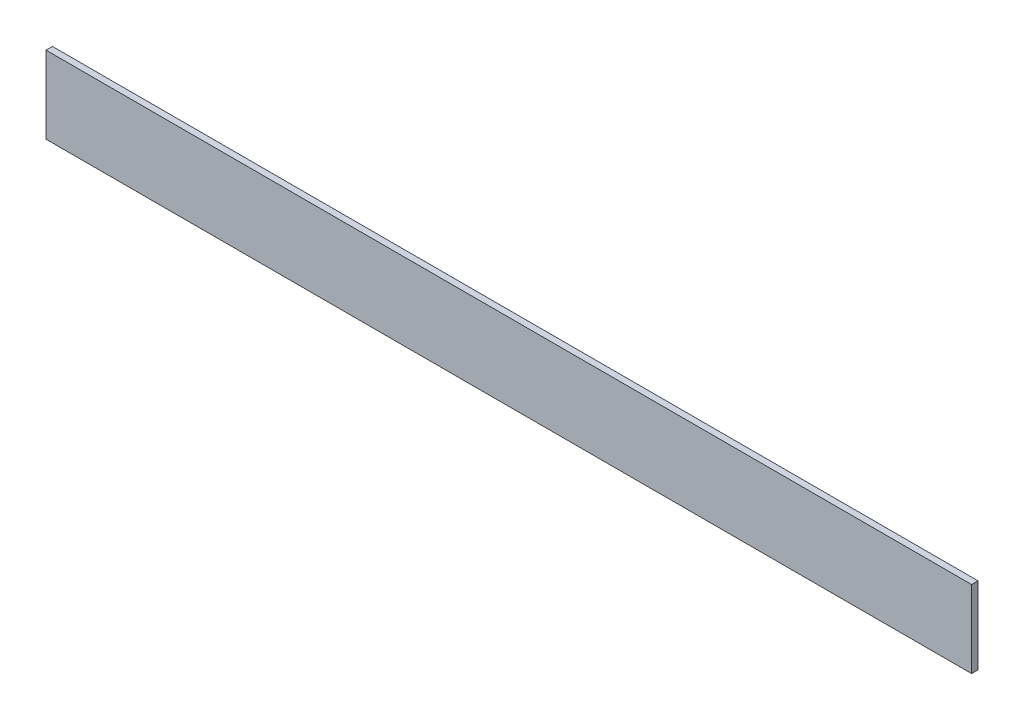
ISO-10303-21;
HEADER;
FILE_DESCRIPTION(('STEP AP214'),'2;1');
FILE_NAME('part.step','',(''),(''),'','','');
FILE_SCHEMA(('AUTOMOTIVE_DESIGN { 1 0 10303 214 1 1 1 1 }'));
ENDSEC;
DATA;
#1=APPLICATION_CONTEXT('core data for automotive mechanical design processes');
#2=APPLICATION_PROTOCOL_DEFINITION('international standard','automotive_design',2000,#1);
#3=PRODUCT_CONTEXT('',#1,'mechanical');
#4=PRODUCT('Part','Part','',(#3));
#5=PRODUCT_RELATED_PRODUCT_CATEGORY('part','',(#4));
#6=PRODUCT_DEFINITION_FORMATION('','',#4);
#7=PRODUCT_DEFINITION_CONTEXT('part definition',#1,'design');
#8=PRODUCT_DEFINITION('design','',#6,#7);
#9=PRODUCT_DEFINITION_SHAPE('','',#8);
#10=(LENGTH_UNIT() NAMED_UNIT(*) SI_UNIT(.MILLI.,.METRE.));
#11=(NAMED_UNIT(*) PLANE_ANGLE_UNIT() SI_UNIT($,.RADIAN.));
#12=(NAMED_UNIT(*) SI_UNIT($,.STERADIAN.) SOLID_ANGLE_UNIT());
#13=UNCERTAINTY_MEASURE_WITH_UNIT(LENGTH_MEASURE(1.E-05),#10,'distance_accuracy_value','');
#14=(GEOMETRIC_REPRESENTATION_CONTEXT(3) GLOBAL_UNCERTAINTY_ASSIGNED_CONTEXT((#13)) GLOBAL_UNIT_ASSIGNED_CONTEXT((#10,
#11,#12)) REPRESENTATION_CONTEXT('',''));
#15=CARTESIAN_POINT('',(0.,0.,0.));
#16=DIRECTION('',(0.,0.,1.));
#17=DIRECTION('',(1.,0.,0.));
#18=AXIS2_PLACEMENT_3D('',#15,#16,#17);
#19=CARTESIAN_POINT('',(914.4,-38.1,-3.175));
#20=DIRECTION('',(0.,0.,1.));
#21=DIRECTION('',(1.,0.,0.));
#22=AXIS2_PLACEMENT_3D('',#19,#20,#21);
#23=PLANE('',#22);
#24=DIRECTION('',(0.,1.,0.));
#25=VECTOR('',#24,1.);
#26=CARTESIAN_POINT('',(0.,-38.1,-3.175));
#27=LINE('',#26,#25);
#28=CARTESIAN_POINT('',(0.,-38.1,-3.175));
#29=VERTEX_POINT('',#28);
#30=CARTESIAN_POINT('',(0.,38.1,-3.175));
#31=VERTEX_POINT('',#30);
#32=EDGE_CURVE('E98',#29,#31,#27,.T.);
#33=ORIENTED_EDGE('',*,*,#32,.T.);
#34=DIRECTION('',(-1.,0.,0.));
#35=VECTOR('',#34,1.);
#36=CARTESIAN_POINT('',(914.4,38.1,-3.175));
#37=LINE('',#36,#35);
#38=CARTESIAN_POINT('',(914.4,38.1,-3.175));
#39=VERTEX_POINT('',#38);
#40=EDGE_CURVE('E11',#39,#31,#37,.T.);
#41=ORIENTED_EDGE('',*,*,#40,.F.);
#42=DIRECTION('',(0.,1.,0.));
#43=VECTOR('',#42,1.);
#44=CARTESIAN_POINT('',(914.4,-38.1,-3.175));
#45=LINE('',#44,#43);
#46=CARTESIAN_POINT('',(914.4,-38.1,-3.175));
#47=VERTEX_POINT('',#46);
#48=EDGE_CURVE('E86',#47,#39,#45,.T.);
#49=ORIENTED_EDGE('',*,*,#48,.F.);
#50=DIRECTION('',(-1.,0.,0.));
#51=VECTOR('',#50,1.);
#52=CARTESIAN_POINT('',(914.4,-38.1,-3.175));
#53=LINE('',#52,#51);
#54=EDGE_CURVE('E94',#47,#29,#53,.T.);
#55=ORIENTED_EDGE('',*,*,#54,.T.);
#56=EDGE_LOOP('',(#33,#41,#49,#55));
#57=FACE_BOUND('',#56,.T.);
#58=ADVANCED_FACE('F35',(#57),#23,.F.);
#59=CARTESIAN_POINT('',(914.4,38.1,3.175));
#60=DIRECTION('',(0.,-1.,0.));
#61=DIRECTION('',(0.,0.,-1.));
#62=AXIS2_PLACEMENT_3D('',#59,#60,#61);
#63=PLANE('',#62);
#64=DIRECTION('',(0.,0.,1.));
#65=VECTOR('',#64,1.);
#66=CARTESIAN_POINT('',(0.,38.1,3.175));
#67=LINE('',#66,#65);
#68=CARTESIAN_POINT('',(0.,38.1,3.175));
#69=VERTEX_POINT('',#68);
#70=EDGE_CURVE('E90',#31,#69,#67,.T.);
#71=ORIENTED_EDGE('',*,*,#70,.T.);
#72=DIRECTION('',(-1.,0.,0.));
#73=VECTOR('',#72,1.);
#74=CARTESIAN_POINT('',(914.4,38.1,3.175));
#75=LINE('',#74,#73);
#76=CARTESIAN_POINT('',(914.4,38.1,3.175));
#77=VERTEX_POINT('',#76);
#78=EDGE_CURVE('E43',#77,#69,#75,.T.);
#79=ORIENTED_EDGE('',*,*,#78,.F.);
#80=DIRECTION('',(0.,0.,1.));
#81=VECTOR('',#80,1.);
#82=CARTESIAN_POINT('',(914.4,38.1,3.175));
#83=LINE('',#82,#81);
#84=EDGE_CURVE('E81',#39,#77,#83,.T.);
#85=ORIENTED_EDGE('',*,*,#84,.F.);
#86=ORIENTED_EDGE('',*,*,#40,.T.);
#87=EDGE_LOOP('',(#71,#79,#85,#86));
#88=FACE_BOUND('',#87,.T.);
#89=ADVANCED_FACE('F89',(#88),#63,.F.);
#90=CARTESIAN_POINT('',(914.4,-38.1,3.175));
#91=DIRECTION('',(0.,0.,-1.));
#92=DIRECTION('',(-1.,0.,0.));
#93=AXIS2_PLACEMENT_3D('',#90,#91,#92);
#94=PLANE('',#93);
#95=DIRECTION('',(0.,-1.,0.));
#96=VECTOR('',#95,1.);
#97=CARTESIAN_POINT('',(0.,-38.1,3.175));
#98=LINE('',#97,#96);
#99=CARTESIAN_POINT('',(0.,-38.1,3.175));
#100=VERTEX_POINT('',#99);
#101=EDGE_CURVE('E68',#69,#100,#98,.T.);
#102=ORIENTED_EDGE('',*,*,#101,.T.);
#103=DIRECTION('',(-1.,0.,0.));
#104=VECTOR('',#103,1.);
#105=CARTESIAN_POINT('',(914.4,-38.1,3.175));
#106=LINE('',#105,#104);
#107=CARTESIAN_POINT('',(914.4,-38.1,3.175));
#108=VERTEX_POINT('',#107);
#109=EDGE_CURVE('E91',#108,#100,#106,.T.);
#110=ORIENTED_EDGE('',*,*,#109,.F.);
#111=DIRECTION('',(0.,-1.,0.));
#112=VECTOR('',#111,1.);
#113=CARTESIAN_POINT('',(914.4,-38.1,3.175));
#114=LINE('',#113,#112);
#115=EDGE_CURVE('E84',#77,#108,#114,.T.);
#116=ORIENTED_EDGE('',*,*,#115,.F.);
#117=ORIENTED_EDGE('',*,*,#78,.T.);
#118=EDGE_LOOP('',(#102,#110,#116,#117));
#119=FACE_BOUND('',#118,.T.);
#120=ADVANCED_FACE('F92',(#119),#94,.F.);
#121=CARTESIAN_POINT('',(914.4,-38.1,3.175));
#122=DIRECTION('',(0.,1.,0.));
#123=DIRECTION('',(0.,0.,1.));
#124=AXIS2_PLACEMENT_3D('',#121,#122,#123);
#125=PLANE('',#124);
#126=DIRECTION('',(0.,0.,-1.));
#127=VECTOR('',#126,1.);
#128=CARTESIAN_POINT('',(0.,-38.1,3.175));
#129=LINE('',#128,#127);
#130=EDGE_CURVE('E74',#100,#29,#129,.T.);
#131=ORIENTED_EDGE('',*,*,#130,.T.);
#132=ORIENTED_EDGE('',*,*,#54,.F.);
#133=DIRECTION('',(0.,0.,-1.));
#134=VECTOR('',#133,1.);
#135=CARTESIAN_POINT('',(914.4,-38.1,3.175));
#136=LINE('',#135,#134);
#137=EDGE_CURVE('E51',#108,#47,#136,.T.);
#138=ORIENTED_EDGE('',*,*,#137,.F.);
#139=ORIENTED_EDGE('',*,*,#109,.T.);
#140=EDGE_LOOP('',(#131,#132,#138,#139));
#141=FACE_BOUND('',#140,.T.);
#142=ADVANCED_FACE('F105',(#141),#125,.F.);
#143=CARTESIAN_POINT('',(914.4,0.,0.));
#144=DIRECTION('',(-1.,0.,0.));
#145=DIRECTION('',(0.,0.,1.));
#146=AXIS2_PLACEMENT_3D('',#143,#144,#145);
#147=PLANE('',#146);
#148=ORIENTED_EDGE('',*,*,#48,.T.);
#149=ORIENTED_EDGE('',*,*,#84,.T.);
#150=ORIENTED_EDGE('',*,*,#115,.T.);
#151=ORIENTED_EDGE('',*,*,#137,.T.);
#152=EDGE_LOOP('',(#148,#149,#150,#151));
#153=FACE_BOUND('',#152,.T.);
#154=ADVANCED_FACE('F82',(#153),#147,.F.);
#155=CARTESIAN_POINT('',(0.,0.,0.));
#156=DIRECTION('',(-1.,0.,0.));
#157=DIRECTION('',(0.,0.,1.));
#158=AXIS2_PLACEMENT_3D('',#155,#156,#157);
#159=PLANE('',#158);
#160=ORIENTED_EDGE('',*,*,#32,.F.);
#161=ORIENTED_EDGE('',*,*,#130,.F.);
#162=ORIENTED_EDGE('',*,*,#101,.F.);
#163=ORIENTED_EDGE('',*,*,#70,.F.);
#164=EDGE_LOOP('',(#160,#161,#162,#163));
#165=FACE_BOUND('',#164,.T.);
#166=ADVANCED_FACE('F108',(#165),#159,.T.);
#167=CLOSED_SHELL('',(#58,#89,#120,#142,#154,#166));
#168=MANIFOLD_SOLID_BREP('B2',#167);
#169=ADVANCED_BREP_SHAPE_REPRESENTATION('',(#18,#168),#14);
#170=SHAPE_DEFINITION_REPRESENTATION(#9,#169);
ENDSEC;
END-ISO-10303-21;
